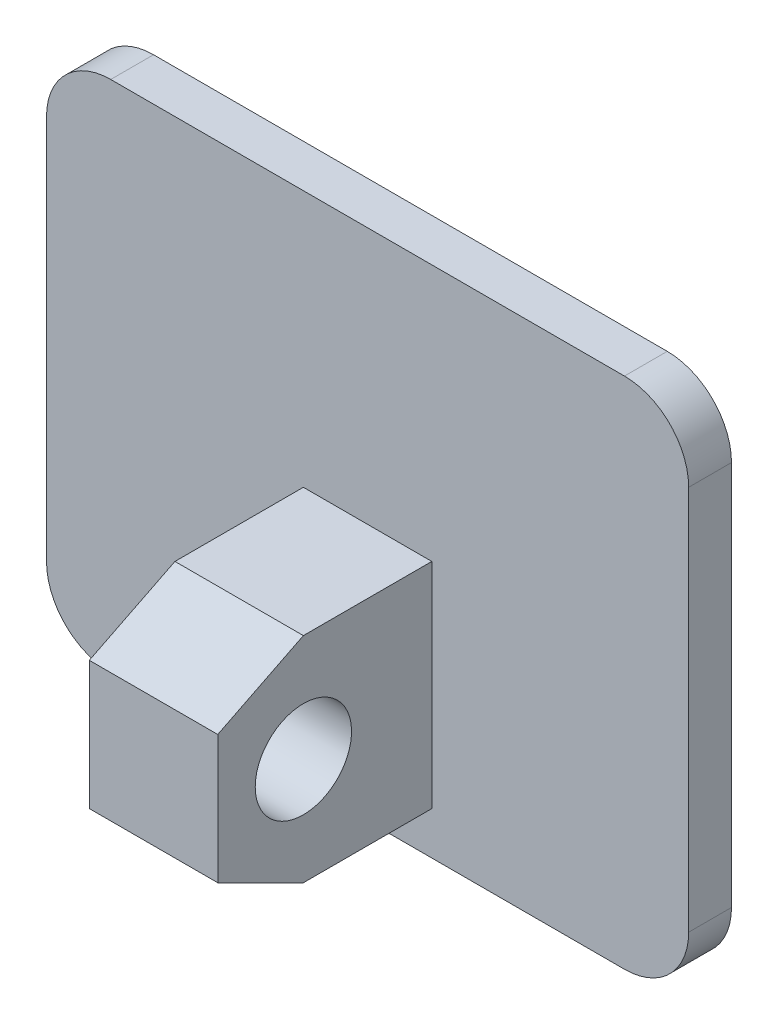
ISO-10303-21;
HEADER;
FILE_DESCRIPTION(('STEP AP214'),'2;1');
FILE_NAME('part.step','',(''),(''),'','','');
FILE_SCHEMA(('AUTOMOTIVE_DESIGN { 1 0 10303 214 1 1 1 1 }'));
ENDSEC;
DATA;
#1=APPLICATION_CONTEXT('core data for automotive mechanical design processes');
#2=APPLICATION_PROTOCOL_DEFINITION('international standard','automotive_design',2000,#1);
#3=PRODUCT_CONTEXT('',#1,'mechanical');
#4=PRODUCT('Part','Part','',(#3));
#5=PRODUCT_RELATED_PRODUCT_CATEGORY('part','',(#4));
#6=PRODUCT_DEFINITION_FORMATION('','',#4);
#7=PRODUCT_DEFINITION_CONTEXT('part definition',#1,'design');
#8=PRODUCT_DEFINITION('design','',#6,#7);
#9=PRODUCT_DEFINITION_SHAPE('','',#8);
#10=(LENGTH_UNIT() NAMED_UNIT(*) SI_UNIT(.MILLI.,.METRE.));
#11=(NAMED_UNIT(*) PLANE_ANGLE_UNIT() SI_UNIT($,.RADIAN.));
#12=(NAMED_UNIT(*) SI_UNIT($,.STERADIAN.) SOLID_ANGLE_UNIT());
#13=UNCERTAINTY_MEASURE_WITH_UNIT(LENGTH_MEASURE(1.E-05),#10,'distance_accuracy_value','');
#14=(GEOMETRIC_REPRESENTATION_CONTEXT(3) GLOBAL_UNCERTAINTY_ASSIGNED_CONTEXT((#13)) GLOBAL_UNIT_ASSIGNED_CONTEXT((#10,
#11,#12)) REPRESENTATION_CONTEXT('',''));
#15=CARTESIAN_POINT('',(0.,0.,0.));
#16=DIRECTION('',(0.,0.,1.));
#17=DIRECTION('',(1.,0.,0.));
#18=AXIS2_PLACEMENT_3D('',#15,#16,#17);
#19=CARTESIAN_POINT('',(-3.,-13.,12.));
#20=DIRECTION('',(0.,1.,0.));
#21=DIRECTION('',(1.,0.,0.));
#22=AXIS2_PLACEMENT_3D('',#19,#20,#21);
#23=PLANE('',#22);
#24=DIRECTION('',(0.,0.,-1.));
#25=VECTOR('',#24,1.);
#26=CARTESIAN_POINT('',(3.,-13.,12.));
#27=LINE('',#26,#25);
#28=CARTESIAN_POINT('',(3.,-13.,8.));
#29=VERTEX_POINT('',#28);
#30=CARTESIAN_POINT('',(3.,-13.,2.));
#31=VERTEX_POINT('',#30);
#32=EDGE_CURVE('E11',#29,#31,#27,.T.);
#33=ORIENTED_EDGE('',*,*,#32,.F.);
#34=DIRECTION('',(-1.,0.,0.));
#35=VECTOR('',#34,1.);
#36=CARTESIAN_POINT('',(-3.,-13.,8.));
#37=LINE('',#36,#35);
#38=CARTESIAN_POINT('',(-3.,-13.,8.));
#39=VERTEX_POINT('',#38);
#40=EDGE_CURVE('E274',#29,#39,#37,.T.);
#41=ORIENTED_EDGE('',*,*,#40,.T.);
#42=DIRECTION('',(0.,0.,-1.));
#43=VECTOR('',#42,1.);
#44=CARTESIAN_POINT('',(-3.,-13.,12.));
#45=LINE('',#44,#43);
#46=CARTESIAN_POINT('',(-3.,-13.,2.));
#47=VERTEX_POINT('',#46);
#48=EDGE_CURVE('E207',#39,#47,#45,.T.);
#49=ORIENTED_EDGE('',*,*,#48,.T.);
#50=DIRECTION('',(1.,0.,0.));
#51=VECTOR('',#50,1.);
#52=CARTESIAN_POINT('',(-3.,-13.,2.));
#53=LINE('',#52,#51);
#54=EDGE_CURVE('E237',#47,#31,#53,.T.);
#55=ORIENTED_EDGE('',*,*,#54,.T.);
#56=EDGE_LOOP('',(#33,#41,#49,#55));
#57=FACE_BOUND('',#56,.T.);
#58=ADVANCED_FACE('F16',(#57),#23,.F.);
#59=CARTESIAN_POINT('',(3.,-13.,12.));
#60=DIRECTION('',(-1.,0.,0.));
#61=DIRECTION('',(0.,0.,1.));
#62=AXIS2_PLACEMENT_3D('',#59,#60,#61);
#63=PLANE('',#62);
#64=CARTESIAN_POINT('',(3.00000000000012,-8.,8.));
#65=DIRECTION('',(1.,0.,0.));
#66=DIRECTION('',(0.,0.,1.));
#67=AXIS2_PLACEMENT_3D('',#64,#65,#66);
#68=CIRCLE('',#67,2.25);
#69=CARTESIAN_POINT('',(3.00000000000012,-8.,10.25));
#70=VERTEX_POINT('',#69);
#71=EDGE_CURVE('E263',#70,#70,#68,.T.);
#72=ORIENTED_EDGE('',*,*,#71,.F.);
#73=EDGE_LOOP('',(#72));
#74=FACE_BOUND('',#73,.T.);
#75=DIRECTION('',(0.,1.,0.));
#76=VECTOR('',#75,1.);
#77=CARTESIAN_POINT('',(3.,-13.,12.));
#78=LINE('',#77,#76);
#79=CARTESIAN_POINT('',(3.,-11.,12.));
#80=VERTEX_POINT('',#79);
#81=CARTESIAN_POINT('',(3.,-5.,12.));
#82=VERTEX_POINT('',#81);
#83=EDGE_CURVE('E213',#80,#82,#78,.T.);
#84=ORIENTED_EDGE('',*,*,#83,.F.);
#85=DIRECTION('',(0.,-0.447213595499958,-0.894427190999916));
#86=VECTOR('',#85,1.);
#87=CARTESIAN_POINT('',(3.,-11.,12.));
#88=LINE('',#87,#86);
#89=EDGE_CURVE('E218',#80,#29,#88,.T.);
#90=ORIENTED_EDGE('',*,*,#89,.T.);
#91=ORIENTED_EDGE('',*,*,#32,.T.);
#92=DIRECTION('',(0.,1.,0.));
#93=VECTOR('',#92,1.);
#94=CARTESIAN_POINT('',(3.,-13.,2.));
#95=LINE('',#94,#93);
#96=CARTESIAN_POINT('',(3.,-3.,2.));
#97=VERTEX_POINT('',#96);
#98=EDGE_CURVE('E234',#31,#97,#95,.T.);
#99=ORIENTED_EDGE('',*,*,#98,.T.);
#100=DIRECTION('',(0.,0.,-1.));
#101=VECTOR('',#100,1.);
#102=CARTESIAN_POINT('',(3.,-3.,12.));
#103=LINE('',#102,#101);
#104=CARTESIAN_POINT('',(3.,-3.,8.));
#105=VERTEX_POINT('',#104);
#106=EDGE_CURVE('E27',#105,#97,#103,.T.);
#107=ORIENTED_EDGE('',*,*,#106,.F.);
#108=DIRECTION('',(0.,-0.447213595499958,0.894427190999916));
#109=VECTOR('',#108,1.);
#110=CARTESIAN_POINT('',(3.,-5.,12.));
#111=LINE('',#110,#109);
#112=EDGE_CURVE('E217',#105,#82,#111,.T.);
#113=ORIENTED_EDGE('',*,*,#112,.T.);
#114=EDGE_LOOP('',(#84,#90,#91,#99,#107,#113));
#115=FACE_BOUND('',#114,.T.);
#116=ADVANCED_FACE('F321',(#74,#115),#63,.F.);
#117=CARTESIAN_POINT('',(3.,-3.,12.));
#118=DIRECTION('',(0.,-1.,0.));
#119=DIRECTION('',(0.,0.,-1.));
#120=AXIS2_PLACEMENT_3D('',#117,#118,#119);
#121=PLANE('',#120);
#122=DIRECTION('',(0.,0.,-1.));
#123=VECTOR('',#122,1.);
#124=CARTESIAN_POINT('',(-3.,-3.,12.));
#125=LINE('',#124,#123);
#126=CARTESIAN_POINT('',(-3.,-3.,8.));
#127=VERTEX_POINT('',#126);
#128=CARTESIAN_POINT('',(-3.,-3.,2.));
#129=VERTEX_POINT('',#128);
#130=EDGE_CURVE('E206',#127,#129,#125,.T.);
#131=ORIENTED_EDGE('',*,*,#130,.F.);
#132=DIRECTION('',(1.,0.,0.));
#133=VECTOR('',#132,1.);
#134=CARTESIAN_POINT('',(3.,-3.,8.));
#135=LINE('',#134,#133);
#136=EDGE_CURVE('E219',#127,#105,#135,.T.);
#137=ORIENTED_EDGE('',*,*,#136,.T.);
#138=ORIENTED_EDGE('',*,*,#106,.T.);
#139=DIRECTION('',(-1.,0.,0.));
#140=VECTOR('',#139,1.);
#141=CARTESIAN_POINT('',(3.,-3.,2.));
#142=LINE('',#141,#140);
#143=EDGE_CURVE('E238',#97,#129,#142,.T.);
#144=ORIENTED_EDGE('',*,*,#143,.T.);
#145=EDGE_LOOP('',(#131,#137,#138,#144));
#146=FACE_BOUND('',#145,.T.);
#147=ADVANCED_FACE('F338',(#146),#121,.F.);
#148=CARTESIAN_POINT('',(-3.,-13.,12.));
#149=DIRECTION('',(0.,0.,1.));
#150=DIRECTION('',(1.,0.,0.));
#151=AXIS2_PLACEMENT_3D('',#148,#149,#150);
#152=PLANE('',#151);
#153=DIRECTION('',(0.,-1.,0.));
#154=VECTOR('',#153,1.);
#155=CARTESIAN_POINT('',(-3.,-3.,12.));
#156=LINE('',#155,#154);
#157=CARTESIAN_POINT('',(-3.,-5.,12.));
#158=VERTEX_POINT('',#157);
#159=CARTESIAN_POINT('',(-3.,-11.,12.));
#160=VERTEX_POINT('',#159);
#161=EDGE_CURVE('E96',#158,#160,#156,.T.);
#162=ORIENTED_EDGE('',*,*,#161,.T.);
#163=DIRECTION('',(1.,0.,0.));
#164=VECTOR('',#163,1.);
#165=CARTESIAN_POINT('',(3.,-11.,12.));
#166=LINE('',#165,#164);
#167=EDGE_CURVE('E214',#160,#80,#166,.T.);
#168=ORIENTED_EDGE('',*,*,#167,.T.);
#169=ORIENTED_EDGE('',*,*,#83,.T.);
#170=DIRECTION('',(-1.,0.,0.));
#171=VECTOR('',#170,1.);
#172=CARTESIAN_POINT('',(-3.,-5.,12.));
#173=LINE('',#172,#171);
#174=EDGE_CURVE('E264',#82,#158,#173,.T.);
#175=ORIENTED_EDGE('',*,*,#174,.T.);
#176=EDGE_LOOP('',(#162,#168,#169,#175));
#177=FACE_BOUND('',#176,.T.);
#178=ADVANCED_FACE('F407',(#177),#152,.T.);
#179=CARTESIAN_POINT('',(15.,-15.,2.));
#180=DIRECTION('',(-1.,0.,0.));
#181=DIRECTION('',(0.,0.,1.));
#182=AXIS2_PLACEMENT_3D('',#179,#180,#181);
#183=PLANE('',#182);
#184=DIRECTION('',(0.,1.,0.));
#185=VECTOR('',#184,1.);
#186=CARTESIAN_POINT('',(15.,-15.,2.));
#187=LINE('',#186,#185);
#188=CARTESIAN_POINT('',(15.,-12.,2.));
#189=VERTEX_POINT('',#188);
#190=CARTESIAN_POINT('',(15.,6.,2.));
#191=VERTEX_POINT('',#190);
#192=EDGE_CURVE('E185',#189,#191,#187,.T.);
#193=ORIENTED_EDGE('',*,*,#192,.F.);
#194=DIRECTION('',(0.,0.,-1.));
#195=VECTOR('',#194,1.);
#196=CARTESIAN_POINT('',(15.,-12.,2.));
#197=LINE('',#196,#195);
#198=CARTESIAN_POINT('',(15.,-12.,0.));
#199=VERTEX_POINT('',#198);
#200=EDGE_CURVE('E183',#189,#199,#197,.T.);
#201=ORIENTED_EDGE('',*,*,#200,.T.);
#202=DIRECTION('',(0.,1.,0.));
#203=VECTOR('',#202,1.);
#204=CARTESIAN_POINT('',(15.,-15.,0.));
#205=LINE('',#204,#203);
#206=CARTESIAN_POINT('',(15.,6.,0.));
#207=VERTEX_POINT('',#206);
#208=EDGE_CURVE('E171',#199,#207,#205,.T.);
#209=ORIENTED_EDGE('',*,*,#208,.T.);
#210=DIRECTION('',(0.,0.,1.));
#211=VECTOR('',#210,1.);
#212=CARTESIAN_POINT('',(15.,6.,2.));
#213=LINE('',#212,#211);
#214=EDGE_CURVE('E233',#207,#191,#213,.T.);
#215=ORIENTED_EDGE('',*,*,#214,.T.);
#216=EDGE_LOOP('',(#193,#201,#209,#215));
#217=FACE_BOUND('',#216,.T.);
#218=ADVANCED_FACE('F184',(#217),#183,.F.);
#219=CARTESIAN_POINT('',(15.,9.,2.));
#220=DIRECTION('',(0.,-1.,0.));
#221=DIRECTION('',(0.,0.,-1.));
#222=AXIS2_PLACEMENT_3D('',#219,#220,#221);
#223=PLANE('',#222);
#224=DIRECTION('',(-1.,0.,0.));
#225=VECTOR('',#224,1.);
#226=CARTESIAN_POINT('',(15.,9.,2.));
#227=LINE('',#226,#225);
#228=CARTESIAN_POINT('',(12.,9.,2.));
#229=VERTEX_POINT('',#228);
#230=CARTESIAN_POINT('',(-12.,9.,2.));
#231=VERTEX_POINT('',#230);
#232=EDGE_CURVE('E20',#229,#231,#227,.T.);
#233=ORIENTED_EDGE('',*,*,#232,.F.);
#234=DIRECTION('',(0.,0.,-1.));
#235=VECTOR('',#234,1.);
#236=CARTESIAN_POINT('',(12.,9.,2.));
#237=LINE('',#236,#235);
#238=CARTESIAN_POINT('',(12.,9.,0.));
#239=VERTEX_POINT('',#238);
#240=EDGE_CURVE('E203',#229,#239,#237,.T.);
#241=ORIENTED_EDGE('',*,*,#240,.T.);
#242=DIRECTION('',(-1.,0.,0.));
#243=VECTOR('',#242,1.);
#244=CARTESIAN_POINT('',(15.,9.,0.));
#245=LINE('',#244,#243);
#246=CARTESIAN_POINT('',(-12.,9.,0.));
#247=VERTEX_POINT('',#246);
#248=EDGE_CURVE('E180',#239,#247,#245,.T.);
#249=ORIENTED_EDGE('',*,*,#248,.T.);
#250=DIRECTION('',(0.,0.,1.));
#251=VECTOR('',#250,1.);
#252=CARTESIAN_POINT('',(-12.,9.,2.));
#253=LINE('',#252,#251);
#254=EDGE_CURVE('E248',#247,#231,#253,.T.);
#255=ORIENTED_EDGE('',*,*,#254,.T.);
#256=EDGE_LOOP('',(#233,#241,#249,#255));
#257=FACE_BOUND('',#256,.T.);
#258=ADVANCED_FACE('F361',(#257),#223,.F.);
#259=CARTESIAN_POINT('',(-15.,-15.,2.));
#260=DIRECTION('',(0.,0.,1.));
#261=DIRECTION('',(1.,0.,0.));
#262=AXIS2_PLACEMENT_3D('',#259,#260,#261);
#263=PLANE('',#262);
#264=DIRECTION('',(0.,-1.,0.));
#265=VECTOR('',#264,1.);
#266=CARTESIAN_POINT('',(-3.,-3.,2.));
#267=LINE('',#266,#265);
#268=EDGE_CURVE('E181',#129,#47,#267,.T.);
#269=ORIENTED_EDGE('',*,*,#268,.F.);
#270=ORIENTED_EDGE('',*,*,#143,.F.);
#271=ORIENTED_EDGE('',*,*,#98,.F.);
#272=ORIENTED_EDGE('',*,*,#54,.F.);
#273=EDGE_LOOP('',(#269,#270,#271,#272));
#274=FACE_BOUND('',#273,.T.);
#275=DIRECTION('',(1.,0.,0.));
#276=VECTOR('',#275,1.);
#277=CARTESIAN_POINT('',(-15.,-15.,2.));
#278=LINE('',#277,#276);
#279=CARTESIAN_POINT('',(-12.,-15.,2.));
#280=VERTEX_POINT('',#279);
#281=CARTESIAN_POINT('',(12.,-15.,2.));
#282=VERTEX_POINT('',#281);
#283=EDGE_CURVE('E226',#280,#282,#278,.T.);
#284=ORIENTED_EDGE('',*,*,#283,.T.);
#285=CARTESIAN_POINT('',(12.,-12.,2.));
#286=DIRECTION('',(0.,0.,1.));
#287=DIRECTION('',(1.,0.,0.));
#288=AXIS2_PLACEMENT_3D('',#285,#286,#287);
#289=CIRCLE('',#288,3.);
#290=EDGE_CURVE('E125',#282,#189,#289,.T.);
#291=ORIENTED_EDGE('',*,*,#290,.T.);
#292=ORIENTED_EDGE('',*,*,#192,.T.);
#293=CARTESIAN_POINT('',(12.,6.,2.));
#294=DIRECTION('',(0.,0.,1.));
#295=DIRECTION('',(1.,0.,0.));
#296=AXIS2_PLACEMENT_3D('',#293,#294,#295);
#297=CIRCLE('',#296,3.);
#298=EDGE_CURVE('E256',#191,#229,#297,.T.);
#299=ORIENTED_EDGE('',*,*,#298,.T.);
#300=ORIENTED_EDGE('',*,*,#232,.T.);
#301=CARTESIAN_POINT('',(-12.,6.,2.));
#302=DIRECTION('',(0.,0.,1.));
#303=DIRECTION('',(1.,0.,0.));
#304=AXIS2_PLACEMENT_3D('',#301,#302,#303);
#305=CIRCLE('',#304,3.);
#306=CARTESIAN_POINT('',(-15.,6.,2.));
#307=VERTEX_POINT('',#306);
#308=EDGE_CURVE('E253',#231,#307,#305,.T.);
#309=ORIENTED_EDGE('',*,*,#308,.T.);
#310=DIRECTION('',(0.,-1.,0.));
#311=VECTOR('',#310,1.);
#312=CARTESIAN_POINT('',(-15.,9.,2.));
#313=LINE('',#312,#311);
#314=CARTESIAN_POINT('',(-15.,-12.,2.));
#315=VERTEX_POINT('',#314);
#316=EDGE_CURVE('E243',#307,#315,#313,.T.);
#317=ORIENTED_EDGE('',*,*,#316,.T.);
#318=CARTESIAN_POINT('',(-12.,-12.,2.));
#319=DIRECTION('',(0.,0.,1.));
#320=DIRECTION('',(1.,0.,0.));
#321=AXIS2_PLACEMENT_3D('',#318,#319,#320);
#322=CIRCLE('',#321,3.);
#323=EDGE_CURVE('E187',#315,#280,#322,.T.);
#324=ORIENTED_EDGE('',*,*,#323,.T.);
#325=EDGE_LOOP('',(#284,#291,#292,#299,#300,#309,#317,#324));
#326=FACE_BOUND('',#325,.T.);
#327=ADVANCED_FACE('F333',(#274,#326),#263,.T.);
#328=CARTESIAN_POINT('',(-15.,-15.,0.));
#329=DIRECTION('',(0.,0.,1.));
#330=DIRECTION('',(1.,0.,0.));
#331=AXIS2_PLACEMENT_3D('',#328,#329,#330);
#332=PLANE('',#331);
#333=ORIENTED_EDGE('',*,*,#208,.F.);
#334=CARTESIAN_POINT('',(12.,-12.,0.));
#335=DIRECTION('',(0.,0.,-1.));
#336=DIRECTION('',(1.,0.,0.));
#337=AXIS2_PLACEMENT_3D('',#334,#335,#336);
#338=CIRCLE('',#337,3.);
#339=CARTESIAN_POINT('',(12.,-15.,0.));
#340=VERTEX_POINT('',#339);
#341=EDGE_CURVE('E140',#199,#340,#338,.T.);
#342=ORIENTED_EDGE('',*,*,#341,.T.);
#343=DIRECTION('',(1.,0.,0.));
#344=VECTOR('',#343,1.);
#345=CARTESIAN_POINT('',(-15.,-15.,0.));
#346=LINE('',#345,#344);
#347=CARTESIAN_POINT('',(-12.,-15.,0.));
#348=VERTEX_POINT('',#347);
#349=EDGE_CURVE('E227',#348,#340,#346,.T.);
#350=ORIENTED_EDGE('',*,*,#349,.F.);
#351=CARTESIAN_POINT('',(-12.,-12.,0.));
#352=DIRECTION('',(0.,0.,-1.));
#353=DIRECTION('',(1.,0.,0.));
#354=AXIS2_PLACEMENT_3D('',#351,#352,#353);
#355=CIRCLE('',#354,3.);
#356=CARTESIAN_POINT('',(-15.,-12.,0.));
#357=VERTEX_POINT('',#356);
#358=EDGE_CURVE('E247',#348,#357,#355,.T.);
#359=ORIENTED_EDGE('',*,*,#358,.T.);
#360=DIRECTION('',(0.,-1.,0.));
#361=VECTOR('',#360,1.);
#362=CARTESIAN_POINT('',(-15.,9.,0.));
#363=LINE('',#362,#361);
#364=CARTESIAN_POINT('',(-15.,6.,0.));
#365=VERTEX_POINT('',#364);
#366=EDGE_CURVE('E244',#365,#357,#363,.T.);
#367=ORIENTED_EDGE('',*,*,#366,.F.);
#368=CARTESIAN_POINT('',(-12.,6.,0.));
#369=DIRECTION('',(0.,0.,-1.));
#370=DIRECTION('',(1.,0.,0.));
#371=AXIS2_PLACEMENT_3D('',#368,#369,#370);
#372=CIRCLE('',#371,3.);
#373=EDGE_CURVE('E252',#365,#247,#372,.T.);
#374=ORIENTED_EDGE('',*,*,#373,.T.);
#375=ORIENTED_EDGE('',*,*,#248,.F.);
#376=CARTESIAN_POINT('',(12.,6.,0.));
#377=DIRECTION('',(0.,0.,-1.));
#378=DIRECTION('',(1.,0.,0.));
#379=AXIS2_PLACEMENT_3D('',#376,#377,#378);
#380=CIRCLE('',#379,3.);
#381=EDGE_CURVE('E175',#239,#207,#380,.T.);
#382=ORIENTED_EDGE('',*,*,#381,.T.);
#383=EDGE_LOOP('',(#333,#342,#350,#359,#367,#374,#375,#382));
#384=FACE_BOUND('',#383,.T.);
#385=ADVANCED_FACE('F173',(#384),#332,.F.);
#386=CARTESIAN_POINT('',(-3.,-3.,12.));
#387=DIRECTION('',(1.,0.,0.));
#388=DIRECTION('',(0.,1.,0.));
#389=AXIS2_PLACEMENT_3D('',#386,#387,#388);
#390=PLANE('',#389);
#391=CARTESIAN_POINT('',(-3.00000000000012,-8.,8.));
#392=DIRECTION('',(-1.,0.,0.));
#393=DIRECTION('',(0.,0.,-1.));
#394=AXIS2_PLACEMENT_3D('',#391,#392,#393);
#395=CIRCLE('',#394,2.25);
#396=CARTESIAN_POINT('',(-3.00000000000012,-8.,5.75));
#397=VERTEX_POINT('',#396);
#398=EDGE_CURVE('E260',#397,#397,#395,.T.);
#399=ORIENTED_EDGE('',*,*,#398,.F.);
#400=EDGE_LOOP('',(#399));
#401=FACE_BOUND('',#400,.T.);
#402=ORIENTED_EDGE('',*,*,#48,.F.);
#403=DIRECTION('',(0.,0.447213595499958,0.894427190999916));
#404=VECTOR('',#403,1.);
#405=CARTESIAN_POINT('',(-3.,-11.,12.));
#406=LINE('',#405,#404);
#407=EDGE_CURVE('E270',#39,#160,#406,.T.);
#408=ORIENTED_EDGE('',*,*,#407,.T.);
#409=ORIENTED_EDGE('',*,*,#161,.F.);
#410=DIRECTION('',(0.,0.447213595499958,-0.894427190999916));
#411=VECTOR('',#410,1.);
#412=CARTESIAN_POINT('',(-3.,-5.,12.));
#413=LINE('',#412,#411);
#414=EDGE_CURVE('E223',#158,#127,#413,.T.);
#415=ORIENTED_EDGE('',*,*,#414,.T.);
#416=ORIENTED_EDGE('',*,*,#130,.T.);
#417=ORIENTED_EDGE('',*,*,#268,.T.);
#418=EDGE_LOOP('',(#402,#408,#409,#415,#416,#417));
#419=FACE_BOUND('',#418,.T.);
#420=ADVANCED_FACE('F328',(#401,#419),#390,.F.);
#421=CARTESIAN_POINT('',(-12.,6.,2.));
#422=DIRECTION('',(0.,0.,-1.));
#423=DIRECTION('',(-1.,0.,0.));
#424=AXIS2_PLACEMENT_3D('',#421,#422,#423);
#425=CYLINDRICAL_SURFACE('',#424,3.);
#426=ORIENTED_EDGE('',*,*,#308,.F.);
#427=ORIENTED_EDGE('',*,*,#254,.F.);
#428=ORIENTED_EDGE('',*,*,#373,.F.);
#429=DIRECTION('',(0.,0.,-1.));
#430=VECTOR('',#429,1.);
#431=CARTESIAN_POINT('',(-15.,6.,2.));
#432=LINE('',#431,#430);
#433=EDGE_CURVE('E277',#307,#365,#432,.T.);
#434=ORIENTED_EDGE('',*,*,#433,.F.);
#435=EDGE_LOOP('',(#426,#427,#428,#434));
#436=FACE_BOUND('',#435,.T.);
#437=ADVANCED_FACE('F362',(#436),#425,.T.);
#438=CARTESIAN_POINT('',(12.,6.,2.));
#439=DIRECTION('',(0.,0.,-1.));
#440=DIRECTION('',(-1.,0.,0.));
#441=AXIS2_PLACEMENT_3D('',#438,#439,#440);
#442=CYLINDRICAL_SURFACE('',#441,3.);
#443=ORIENTED_EDGE('',*,*,#298,.F.);
#444=ORIENTED_EDGE('',*,*,#214,.F.);
#445=ORIENTED_EDGE('',*,*,#381,.F.);
#446=ORIENTED_EDGE('',*,*,#240,.F.);
#447=EDGE_LOOP('',(#443,#444,#445,#446));
#448=FACE_BOUND('',#447,.T.);
#449=ADVANCED_FACE('F366',(#448),#442,.T.);
#450=CARTESIAN_POINT('',(-12.,-12.,2.));
#451=DIRECTION('',(0.,0.,-1.));
#452=DIRECTION('',(-1.,0.,0.));
#453=AXIS2_PLACEMENT_3D('',#450,#451,#452);
#454=CYLINDRICAL_SURFACE('',#453,3.);
#455=ORIENTED_EDGE('',*,*,#323,.F.);
#456=DIRECTION('',(0.,0.,1.));
#457=VECTOR('',#456,1.);
#458=CARTESIAN_POINT('',(-15.,-12.,2.));
#459=LINE('',#458,#457);
#460=EDGE_CURVE('E239',#357,#315,#459,.T.);
#461=ORIENTED_EDGE('',*,*,#460,.F.);
#462=ORIENTED_EDGE('',*,*,#358,.F.);
#463=DIRECTION('',(0.,0.,-1.));
#464=VECTOR('',#463,1.);
#465=CARTESIAN_POINT('',(-12.,-15.,2.));
#466=LINE('',#465,#464);
#467=EDGE_CURVE('E199',#280,#348,#466,.T.);
#468=ORIENTED_EDGE('',*,*,#467,.F.);
#469=EDGE_LOOP('',(#455,#461,#462,#468));
#470=FACE_BOUND('',#469,.T.);
#471=ADVANCED_FACE('F368',(#470),#454,.T.);
#472=CARTESIAN_POINT('',(12.,-12.,2.));
#473=DIRECTION('',(0.,0.,-1.));
#474=DIRECTION('',(-1.,0.,0.));
#475=AXIS2_PLACEMENT_3D('',#472,#473,#474);
#476=CYLINDRICAL_SURFACE('',#475,3.);
#477=ORIENTED_EDGE('',*,*,#290,.F.);
#478=DIRECTION('',(0.,0.,1.));
#479=VECTOR('',#478,1.);
#480=CARTESIAN_POINT('',(12.,-15.,2.));
#481=LINE('',#480,#479);
#482=EDGE_CURVE('E191',#340,#282,#481,.T.);
#483=ORIENTED_EDGE('',*,*,#482,.F.);
#484=ORIENTED_EDGE('',*,*,#341,.F.);
#485=ORIENTED_EDGE('',*,*,#200,.F.);
#486=EDGE_LOOP('',(#477,#483,#484,#485));
#487=FACE_BOUND('',#486,.T.);
#488=ADVANCED_FACE('F189',(#487),#476,.T.);
#489=CARTESIAN_POINT('',(-15.,-15.,2.));
#490=DIRECTION('',(0.,1.,0.));
#491=DIRECTION('',(1.,0.,0.));
#492=AXIS2_PLACEMENT_3D('',#489,#490,#491);
#493=PLANE('',#492);
#494=ORIENTED_EDGE('',*,*,#349,.T.);
#495=ORIENTED_EDGE('',*,*,#482,.T.);
#496=ORIENTED_EDGE('',*,*,#283,.F.);
#497=ORIENTED_EDGE('',*,*,#467,.T.);
#498=EDGE_LOOP('',(#494,#495,#496,#497));
#499=FACE_BOUND('',#498,.T.);
#500=ADVANCED_FACE('F400',(#499),#493,.F.);
#501=CARTESIAN_POINT('',(-15.,9.,2.));
#502=DIRECTION('',(1.,0.,0.));
#503=DIRECTION('',(0.,1.,0.));
#504=AXIS2_PLACEMENT_3D('',#501,#502,#503);
#505=PLANE('',#504);
#506=ORIENTED_EDGE('',*,*,#366,.T.);
#507=ORIENTED_EDGE('',*,*,#460,.T.);
#508=ORIENTED_EDGE('',*,*,#316,.F.);
#509=ORIENTED_EDGE('',*,*,#433,.T.);
#510=EDGE_LOOP('',(#506,#507,#508,#509));
#511=FACE_BOUND('',#510,.T.);
#512=ADVANCED_FACE('F18',(#511),#505,.F.);
#513=CARTESIAN_POINT('',(29997.0000000011,-8.,8.));
#514=DIRECTION('',(-1.,0.,0.));
#515=DIRECTION('',(0.,-1.,0.));
#516=AXIS2_PLACEMENT_3D('',#513,#514,#515);
#517=CYLINDRICAL_SURFACE('',#516,2.25);
#518=ORIENTED_EDGE('',*,*,#71,.T.);
#519=EDGE_LOOP('',(#518));
#520=FACE_BOUND('',#519,.T.);
#521=ORIENTED_EDGE('',*,*,#398,.T.);
#522=EDGE_LOOP('',(#521));
#523=FACE_BOUND('',#522,.T.);
#524=ADVANCED_FACE('F389',(#520,#523),#517,.F.);
#525=CARTESIAN_POINT('',(-3.,-5.,12.));
#526=DIRECTION('',(0.,0.894427190999916,0.447213595499958));
#527=DIRECTION('',(1.,0.,0.));
#528=AXIS2_PLACEMENT_3D('',#525,#526,#527);
#529=PLANE('',#528);
#530=ORIENTED_EDGE('',*,*,#112,.F.);
#531=ORIENTED_EDGE('',*,*,#136,.F.);
#532=ORIENTED_EDGE('',*,*,#414,.F.);
#533=ORIENTED_EDGE('',*,*,#174,.F.);
#534=EDGE_LOOP('',(#530,#531,#532,#533));
#535=FACE_BOUND('',#534,.T.);
#536=ADVANCED_FACE('F342',(#535),#529,.T.);
#537=CARTESIAN_POINT('',(-3.,-11.,12.));
#538=DIRECTION('',(0.,-0.894427190999916,0.447213595499958));
#539=DIRECTION('',(-1.,0.,0.));
#540=AXIS2_PLACEMENT_3D('',#537,#538,#539);
#541=PLANE('',#540);
#542=ORIENTED_EDGE('',*,*,#407,.F.);
#543=ORIENTED_EDGE('',*,*,#40,.F.);
#544=ORIENTED_EDGE('',*,*,#89,.F.);
#545=ORIENTED_EDGE('',*,*,#167,.F.);
#546=EDGE_LOOP('',(#542,#543,#544,#545));
#547=FACE_BOUND('',#546,.T.);
#548=ADVANCED_FACE('F325',(#547),#541,.T.);
#549=CLOSED_SHELL('',(#58,#116,#147,#178,#218,#258,#327,#385,#420,#437,#449,#471,#488,#500,#512,
#524,#536,#548));
#550=MANIFOLD_SOLID_BREP('B1',#549);
#551=ADVANCED_BREP_SHAPE_REPRESENTATION('',(#18,#550),#14);
#552=SHAPE_DEFINITION_REPRESENTATION(#9,#551);
ENDSEC;
END-ISO-10303-21;
